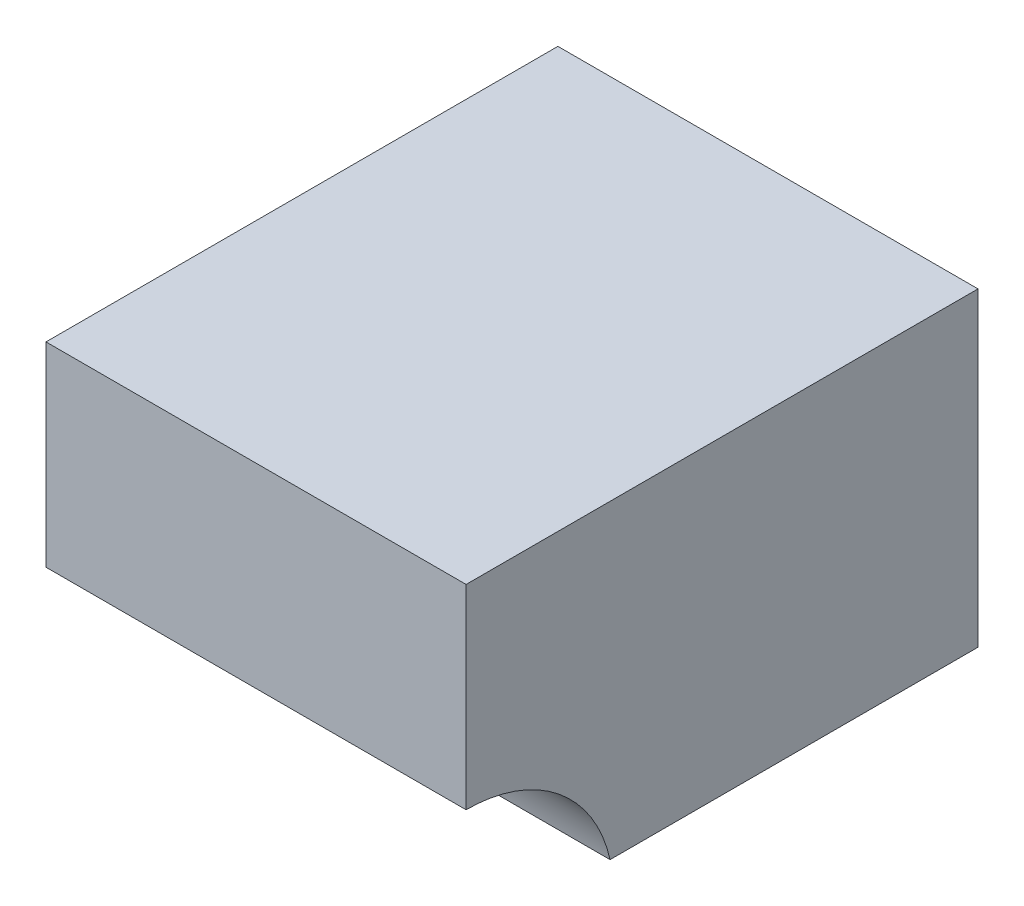
ISO-10303-21;
HEADER;
FILE_DESCRIPTION(('STEP AP214'),'2;1');
FILE_NAME('part.step','',(''),(''),'','','');
FILE_SCHEMA(('AUTOMOTIVE_DESIGN { 1 0 10303 214 1 1 1 1 }'));
ENDSEC;
DATA;
#1=APPLICATION_CONTEXT('core data for automotive mechanical design processes');
#2=APPLICATION_PROTOCOL_DEFINITION('international standard','automotive_design',2000,#1);
#3=PRODUCT_CONTEXT('',#1,'mechanical');
#4=PRODUCT('Part','Part','',(#3));
#5=PRODUCT_RELATED_PRODUCT_CATEGORY('part','',(#4));
#6=PRODUCT_DEFINITION_FORMATION('','',#4);
#7=PRODUCT_DEFINITION_CONTEXT('part definition',#1,'design');
#8=PRODUCT_DEFINITION('design','',#6,#7);
#9=PRODUCT_DEFINITION_SHAPE('','',#8);
#10=(LENGTH_UNIT() NAMED_UNIT(*) SI_UNIT(.MILLI.,.METRE.));
#11=(NAMED_UNIT(*) PLANE_ANGLE_UNIT() SI_UNIT($,.RADIAN.));
#12=(NAMED_UNIT(*) SI_UNIT($,.STERADIAN.) SOLID_ANGLE_UNIT());
#13=UNCERTAINTY_MEASURE_WITH_UNIT(LENGTH_MEASURE(1.E-05),#10,'distance_accuracy_value','');
#14=(GEOMETRIC_REPRESENTATION_CONTEXT(3) GLOBAL_UNCERTAINTY_ASSIGNED_CONTEXT((#13)) GLOBAL_UNIT_ASSIGNED_CONTEXT((#10,
#11,#12)) REPRESENTATION_CONTEXT('',''));
#15=CARTESIAN_POINT('',(0.,0.,0.));
#16=DIRECTION('',(0.,0.,1.));
#17=DIRECTION('',(1.,0.,0.));
#18=AXIS2_PLACEMENT_3D('',#15,#16,#17);
#19=CARTESIAN_POINT('',(33.3502,24.638,40.64));
#20=DIRECTION('',(0.,0.,-1.));
#21=DIRECTION('',(0.,1.,0.));
#22=AXIS2_PLACEMENT_3D('',#19,#20,#21);
#23=PLANE('',#22);
#24=DIRECTION('',(0.,-1.,0.));
#25=VECTOR('',#24,1.);
#26=CARTESIAN_POINT('',(0.,24.638,40.64));
#27=LINE('',#26,#25);
#28=CARTESIAN_POINT('',(0.,24.638,40.64));
#29=VERTEX_POINT('',#28);
#30=CARTESIAN_POINT('',(0.,9.144,40.64));
#31=VERTEX_POINT('',#30);
#32=EDGE_CURVE('E111',#29,#31,#27,.T.);
#33=ORIENTED_EDGE('',*,*,#32,.T.);
#34=DIRECTION('',(-1.,0.,0.));
#35=VECTOR('',#34,1.);
#36=CARTESIAN_POINT('',(33.3502,9.144,40.64));
#37=LINE('',#36,#35);
#38=CARTESIAN_POINT('',(33.3502,9.144,40.64));
#39=VERTEX_POINT('',#38);
#40=EDGE_CURVE('E11',#39,#31,#37,.T.);
#41=ORIENTED_EDGE('',*,*,#40,.F.);
#42=DIRECTION('',(0.,-1.,0.));
#43=VECTOR('',#42,1.);
#44=CARTESIAN_POINT('',(33.3502,24.638,40.64));
#45=LINE('',#44,#43);
#46=CARTESIAN_POINT('',(33.3502,24.638,40.64));
#47=VERTEX_POINT('',#46);
#48=EDGE_CURVE('E119',#47,#39,#45,.T.);
#49=ORIENTED_EDGE('',*,*,#48,.F.);
#50=DIRECTION('',(-1.,0.,0.));
#51=VECTOR('',#50,1.);
#52=CARTESIAN_POINT('',(33.3502,24.638,40.64));
#53=LINE('',#52,#51);
#54=EDGE_CURVE('E107',#47,#29,#53,.T.);
#55=ORIENTED_EDGE('',*,*,#54,.T.);
#56=EDGE_LOOP('',(#33,#41,#49,#55));
#57=FACE_BOUND('',#56,.T.);
#58=ADVANCED_FACE('F37',(#57),#23,.F.);
#59=CARTESIAN_POINT('',(33.3502,-2.57174999999999,40.64));
#60=DIRECTION('',(-1.,0.,0.));
#61=DIRECTION('',(0.,0.,1.));
#62=AXIS2_PLACEMENT_3D('',#59,#60,#61);
#63=CYLINDRICAL_SURFACE('',#62,11.71575);
#64=CARTESIAN_POINT('',(0.,-2.57174999999999,40.64));
#65=DIRECTION('',(-1.,0.,0.));
#66=DIRECTION('',(0.,0.,-1.));
#67=AXIS2_PLACEMENT_3D('',#64,#65,#66);
#68=CIRCLE('',#67,11.71575);
#69=CARTESIAN_POINT('',(0.,0.,29.21));
#70=VERTEX_POINT('',#69);
#71=EDGE_CURVE('E114',#31,#70,#68,.T.);
#72=ORIENTED_EDGE('',*,*,#71,.T.);
#73=DIRECTION('',(-1.,0.,0.));
#74=VECTOR('',#73,1.);
#75=CARTESIAN_POINT('',(33.3502,0.,29.21));
#76=LINE('',#75,#74);
#77=CARTESIAN_POINT('',(33.3502,0.,29.21));
#78=VERTEX_POINT('',#77);
#79=EDGE_CURVE('E45',#78,#70,#76,.T.);
#80=ORIENTED_EDGE('',*,*,#79,.F.);
#81=CARTESIAN_POINT('',(33.3502,-2.57174999999999,40.64));
#82=DIRECTION('',(-1.,0.,0.));
#83=DIRECTION('',(0.,0.,-1.));
#84=AXIS2_PLACEMENT_3D('',#81,#82,#83);
#85=CIRCLE('',#84,11.71575);
#86=EDGE_CURVE('E87',#39,#78,#85,.T.);
#87=ORIENTED_EDGE('',*,*,#86,.F.);
#88=ORIENTED_EDGE('',*,*,#40,.T.);
#89=EDGE_LOOP('',(#72,#80,#87,#88));
#90=FACE_BOUND('',#89,.T.);
#91=ADVANCED_FACE('F138',(#90),#63,.F.);
#92=CARTESIAN_POINT('',(33.3502,0.,0.));
#93=DIRECTION('',(0.,1.,0.));
#94=DIRECTION('',(0.,0.,1.));
#95=AXIS2_PLACEMENT_3D('',#92,#93,#94);
#96=PLANE('',#95);
#97=DIRECTION('',(0.,0.,-1.));
#98=VECTOR('',#97,1.);
#99=CARTESIAN_POINT('',(0.,0.,0.));
#100=LINE('',#99,#98);
#101=CARTESIAN_POINT('',(0.,0.,0.));
#102=VERTEX_POINT('',#101);
#103=EDGE_CURVE('E102',#70,#102,#100,.T.);
#104=ORIENTED_EDGE('',*,*,#103,.T.);
#105=DIRECTION('',(-1.,0.,0.));
#106=VECTOR('',#105,1.);
#107=CARTESIAN_POINT('',(33.3502,0.,0.));
#108=LINE('',#107,#106);
#109=CARTESIAN_POINT('',(33.3502,0.,0.));
#110=VERTEX_POINT('',#109);
#111=EDGE_CURVE('E99',#110,#102,#108,.T.);
#112=ORIENTED_EDGE('',*,*,#111,.F.);
#113=DIRECTION('',(0.,0.,-1.));
#114=VECTOR('',#113,1.);
#115=CARTESIAN_POINT('',(33.3502,0.,0.));
#116=LINE('',#115,#114);
#117=EDGE_CURVE('E91',#78,#110,#116,.T.);
#118=ORIENTED_EDGE('',*,*,#117,.F.);
#119=ORIENTED_EDGE('',*,*,#79,.T.);
#120=EDGE_LOOP('',(#104,#112,#118,#119));
#121=FACE_BOUND('',#120,.T.);
#122=ADVANCED_FACE('F100',(#121),#96,.F.);
#123=CARTESIAN_POINT('',(33.3502,24.638,0.));
#124=DIRECTION('',(0.,0.,1.));
#125=DIRECTION('',(0.,-1.,0.));
#126=AXIS2_PLACEMENT_3D('',#123,#124,#125);
#127=PLANE('',#126);
#128=DIRECTION('',(0.,1.,0.));
#129=VECTOR('',#128,1.);
#130=CARTESIAN_POINT('',(0.,24.638,0.));
#131=LINE('',#130,#129);
#132=CARTESIAN_POINT('',(0.,24.638,0.));
#133=VERTEX_POINT('',#132);
#134=EDGE_CURVE('E73',#102,#133,#131,.T.);
#135=ORIENTED_EDGE('',*,*,#134,.T.);
#136=DIRECTION('',(-1.,0.,0.));
#137=VECTOR('',#136,1.);
#138=CARTESIAN_POINT('',(33.3502,24.638,0.));
#139=LINE('',#138,#137);
#140=CARTESIAN_POINT('',(33.3502,24.638,0.));
#141=VERTEX_POINT('',#140);
#142=EDGE_CURVE('E103',#141,#133,#139,.T.);
#143=ORIENTED_EDGE('',*,*,#142,.F.);
#144=DIRECTION('',(0.,1.,0.));
#145=VECTOR('',#144,1.);
#146=CARTESIAN_POINT('',(33.3502,24.638,0.));
#147=LINE('',#146,#145);
#148=EDGE_CURVE('E95',#110,#141,#147,.T.);
#149=ORIENTED_EDGE('',*,*,#148,.F.);
#150=ORIENTED_EDGE('',*,*,#111,.T.);
#151=EDGE_LOOP('',(#135,#143,#149,#150));
#152=FACE_BOUND('',#151,.T.);
#153=ADVANCED_FACE('F105',(#152),#127,.F.);
#154=CARTESIAN_POINT('',(33.3502,24.638,40.64));
#155=DIRECTION('',(0.,-1.,0.));
#156=DIRECTION('',(0.,0.,-1.));
#157=AXIS2_PLACEMENT_3D('',#154,#155,#156);
#158=PLANE('',#157);
#159=DIRECTION('',(0.,0.,1.));
#160=VECTOR('',#159,1.);
#161=CARTESIAN_POINT('',(0.,24.638,40.64));
#162=LINE('',#161,#160);
#163=EDGE_CURVE('E79',#133,#29,#162,.T.);
#164=ORIENTED_EDGE('',*,*,#163,.T.);
#165=ORIENTED_EDGE('',*,*,#54,.F.);
#166=DIRECTION('',(0.,0.,1.));
#167=VECTOR('',#166,1.);
#168=CARTESIAN_POINT('',(33.3502,24.638,40.64));
#169=LINE('',#168,#167);
#170=EDGE_CURVE('E53',#141,#47,#169,.T.);
#171=ORIENTED_EDGE('',*,*,#170,.F.);
#172=ORIENTED_EDGE('',*,*,#142,.T.);
#173=EDGE_LOOP('',(#164,#165,#171,#172));
#174=FACE_BOUND('',#173,.T.);
#175=ADVANCED_FACE('F127',(#174),#158,.F.);
#176=CARTESIAN_POINT('',(33.3502,-2.57174999999999,40.64));
#177=DIRECTION('',(1.,0.,0.));
#178=DIRECTION('',(0.,0.,-1.));
#179=AXIS2_PLACEMENT_3D('',#176,#177,#178);
#180=PLANE('',#179);
#181=ORIENTED_EDGE('',*,*,#48,.T.);
#182=ORIENTED_EDGE('',*,*,#86,.T.);
#183=ORIENTED_EDGE('',*,*,#117,.T.);
#184=ORIENTED_EDGE('',*,*,#148,.T.);
#185=ORIENTED_EDGE('',*,*,#170,.T.);
#186=EDGE_LOOP('',(#181,#182,#183,#184,#185));
#187=FACE_BOUND('',#186,.T.);
#188=ADVANCED_FACE('F93',(#187),#180,.T.);
#189=CARTESIAN_POINT('',(0.,-2.57174999999999,40.64));
#190=DIRECTION('',(1.,0.,0.));
#191=DIRECTION('',(0.,0.,-1.));
#192=AXIS2_PLACEMENT_3D('',#189,#190,#191);
#193=PLANE('',#192);
#194=ORIENTED_EDGE('',*,*,#32,.F.);
#195=ORIENTED_EDGE('',*,*,#163,.F.);
#196=ORIENTED_EDGE('',*,*,#134,.F.);
#197=ORIENTED_EDGE('',*,*,#103,.F.);
#198=ORIENTED_EDGE('',*,*,#71,.F.);
#199=EDGE_LOOP('',(#194,#195,#196,#197,#198));
#200=FACE_BOUND('',#199,.T.);
#201=ADVANCED_FACE('F123',(#200),#193,.F.);
#202=CLOSED_SHELL('',(#58,#91,#122,#153,#175,#188,#201));
#203=MANIFOLD_SOLID_BREP('B2',#202);
#204=ADVANCED_BREP_SHAPE_REPRESENTATION('',(#18,#203),#14);
#205=SHAPE_DEFINITION_REPRESENTATION(#9,#204);
ENDSEC;
END-ISO-10303-21;
